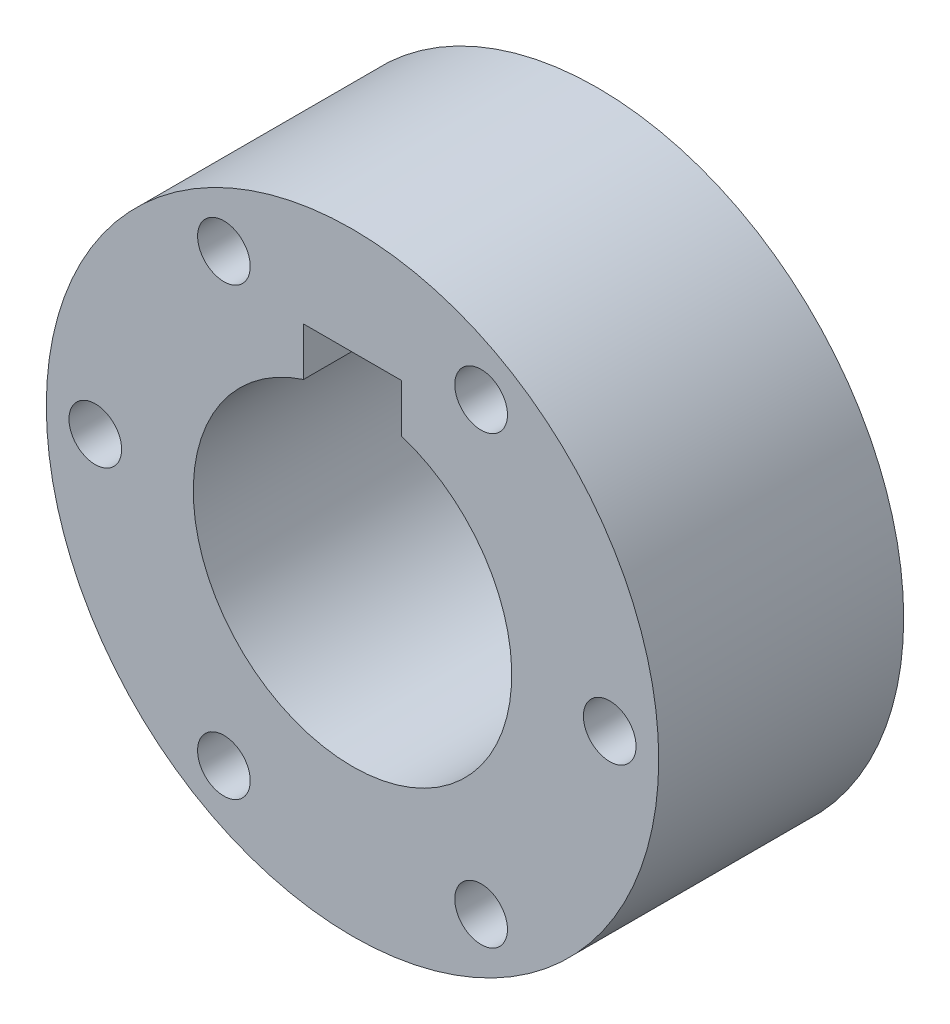
ISO-10303-21;
HEADER;
FILE_DESCRIPTION(('STEP AP214'),'2;1');
FILE_NAME('part.step','',(''),(''),'','','');
FILE_SCHEMA(('AUTOMOTIVE_DESIGN { 1 0 10303 214 1 1 1 1 }'));
ENDSEC;
DATA;
#1=APPLICATION_CONTEXT('core data for automotive mechanical design processes');
#2=APPLICATION_PROTOCOL_DEFINITION('international standard','automotive_design',2000,#1);
#3=PRODUCT_CONTEXT('',#1,'mechanical');
#4=PRODUCT('Part','Part','',(#3));
#5=PRODUCT_RELATED_PRODUCT_CATEGORY('part','',(#4));
#6=PRODUCT_DEFINITION_FORMATION('','',#4);
#7=PRODUCT_DEFINITION_CONTEXT('part definition',#1,'design');
#8=PRODUCT_DEFINITION('design','',#6,#7);
#9=PRODUCT_DEFINITION_SHAPE('','',#8);
#10=(LENGTH_UNIT() NAMED_UNIT(*) SI_UNIT(.MILLI.,.METRE.));
#11=(NAMED_UNIT(*) PLANE_ANGLE_UNIT() SI_UNIT($,.RADIAN.));
#12=(NAMED_UNIT(*) SI_UNIT($,.STERADIAN.) SOLID_ANGLE_UNIT());
#13=UNCERTAINTY_MEASURE_WITH_UNIT(LENGTH_MEASURE(1.E-05),#10,'distance_accuracy_value','');
#14=(GEOMETRIC_REPRESENTATION_CONTEXT(3) GLOBAL_UNCERTAINTY_ASSIGNED_CONTEXT((#13)) GLOBAL_UNIT_ASSIGNED_CONTEXT((#10,
#11,#12)) REPRESENTATION_CONTEXT('',''));
#15=CARTESIAN_POINT('',(0.,0.,0.));
#16=DIRECTION('',(0.,0.,1.));
#17=DIRECTION('',(1.,0.,0.));
#18=AXIS2_PLACEMENT_3D('',#15,#16,#17);
#19=CARTESIAN_POINT('',(0.,0.,20.));
#20=DIRECTION('',(0.,0.,-1.));
#21=DIRECTION('',(-1.,0.,0.));
#22=AXIS2_PLACEMENT_3D('',#19,#20,#21);
#23=CYLINDRICAL_SURFACE('',#22,25.);
#24=CARTESIAN_POINT('',(0.,0.,20.));
#25=DIRECTION('',(0.,0.,1.));
#26=DIRECTION('',(1.,0.,0.));
#27=AXIS2_PLACEMENT_3D('',#24,#25,#26);
#28=CIRCLE('',#27,25.);
#29=CARTESIAN_POINT('',(25.,0.,20.));
#30=VERTEX_POINT('',#29);
#31=EDGE_CURVE('E11',#30,#30,#28,.T.);
#32=ORIENTED_EDGE('',*,*,#31,.F.);
#33=EDGE_LOOP('',(#32));
#34=FACE_BOUND('',#33,.T.);
#35=CARTESIAN_POINT('',(0.,0.,0.));
#36=DIRECTION('',(0.,0.,1.));
#37=DIRECTION('',(1.,0.,0.));
#38=AXIS2_PLACEMENT_3D('',#35,#36,#37);
#39=CIRCLE('',#38,25.);
#40=CARTESIAN_POINT('',(25.,0.,0.));
#41=VERTEX_POINT('',#40);
#42=EDGE_CURVE('E37',#41,#41,#39,.T.);
#43=ORIENTED_EDGE('',*,*,#42,.T.);
#44=EDGE_LOOP('',(#43));
#45=FACE_BOUND('',#44,.T.);
#46=ADVANCED_FACE('F34',(#34,#45),#23,.T.);
#47=CARTESIAN_POINT('',(0.,0.,20.));
#48=DIRECTION('',(0.,0.,1.));
#49=DIRECTION('',(1.,0.,0.));
#50=AXIS2_PLACEMENT_3D('',#47,#48,#49);
#51=PLANE('',#50);
#52=CARTESIAN_POINT('',(21.,0.,20.));
#53=DIRECTION('',(0.,0.,1.));
#54=DIRECTION('',(1.,0.,0.));
#55=AXIS2_PLACEMENT_3D('',#52,#53,#54);
#56=CIRCLE('',#55,2.15);
#57=CARTESIAN_POINT('',(23.15,0.,20.));
#58=VERTEX_POINT('',#57);
#59=EDGE_CURVE('E184',#58,#58,#56,.T.);
#60=ORIENTED_EDGE('',*,*,#59,.F.);
#61=EDGE_LOOP('',(#60));
#62=FACE_BOUND('',#61,.T.);
#63=CARTESIAN_POINT('',(10.5,-18.1865334794732,20.));
#64=DIRECTION('',(0.,0.,1.));
#65=DIRECTION('',(1.,0.,0.));
#66=AXIS2_PLACEMENT_3D('',#63,#64,#65);
#67=CIRCLE('',#66,2.15);
#68=CARTESIAN_POINT('',(12.65,-18.1865334794732,20.));
#69=VERTEX_POINT('',#68);
#70=EDGE_CURVE('E186',#69,#69,#67,.T.);
#71=ORIENTED_EDGE('',*,*,#70,.F.);
#72=EDGE_LOOP('',(#71));
#73=FACE_BOUND('',#72,.T.);
#74=CARTESIAN_POINT('',(-10.5,-18.1865334794732,20.));
#75=DIRECTION('',(0.,0.,1.));
#76=DIRECTION('',(1.,0.,0.));
#77=AXIS2_PLACEMENT_3D('',#74,#75,#76);
#78=CIRCLE('',#77,2.15);
#79=CARTESIAN_POINT('',(-8.35,-18.1865334794732,20.));
#80=VERTEX_POINT('',#79);
#81=EDGE_CURVE('E194',#80,#80,#78,.T.);
#82=ORIENTED_EDGE('',*,*,#81,.F.);
#83=EDGE_LOOP('',(#82));
#84=FACE_BOUND('',#83,.T.);
#85=CARTESIAN_POINT('',(-21.,0.,20.));
#86=DIRECTION('',(0.,0.,1.));
#87=DIRECTION('',(1.,0.,0.));
#88=AXIS2_PLACEMENT_3D('',#85,#86,#87);
#89=CIRCLE('',#88,2.15);
#90=CARTESIAN_POINT('',(-18.85,0.,20.));
#91=VERTEX_POINT('',#90);
#92=EDGE_CURVE('E200',#91,#91,#89,.T.);
#93=ORIENTED_EDGE('',*,*,#92,.F.);
#94=EDGE_LOOP('',(#93));
#95=FACE_BOUND('',#94,.T.);
#96=CARTESIAN_POINT('',(-10.5,18.1865334794732,20.));
#97=DIRECTION('',(0.,0.,1.));
#98=DIRECTION('',(1.,0.,0.));
#99=AXIS2_PLACEMENT_3D('',#96,#97,#98);
#100=CIRCLE('',#99,2.15);
#101=CARTESIAN_POINT('',(-8.35000000000001,18.1865334794732,20.));
#102=VERTEX_POINT('',#101);
#103=EDGE_CURVE('E206',#102,#102,#100,.T.);
#104=ORIENTED_EDGE('',*,*,#103,.F.);
#105=EDGE_LOOP('',(#104));
#106=FACE_BOUND('',#105,.T.);
#107=CARTESIAN_POINT('',(10.5,18.1865334794732,20.));
#108=DIRECTION('',(0.,0.,1.));
#109=DIRECTION('',(1.,0.,0.));
#110=AXIS2_PLACEMENT_3D('',#107,#108,#109);
#111=CIRCLE('',#110,2.15);
#112=CARTESIAN_POINT('',(12.65,18.1865334794732,20.));
#113=VERTEX_POINT('',#112);
#114=EDGE_CURVE('E211',#113,#113,#111,.T.);
#115=ORIENTED_EDGE('',*,*,#114,.F.);
#116=EDGE_LOOP('',(#115));
#117=FACE_BOUND('',#116,.T.);
#118=DIRECTION('',(-1.,0.,0.));
#119=VECTOR('',#118,1.);
#120=CARTESIAN_POINT('',(3.99999999999999,16.3,20.));
#121=LINE('',#120,#119);
#122=CARTESIAN_POINT('',(3.99999999999999,16.3,20.));
#123=VERTEX_POINT('',#122);
#124=CARTESIAN_POINT('',(-4.00000000000001,16.3,20.));
#125=VERTEX_POINT('',#124);
#126=EDGE_CURVE('E48',#123,#125,#121,.T.);
#127=ORIENTED_EDGE('',*,*,#126,.F.);
#128=DIRECTION('',(0.,-1.,0.));
#129=VECTOR('',#128,1.);
#130=CARTESIAN_POINT('',(3.99999999999999,16.3,20.));
#131=LINE('',#130,#129);
#132=CARTESIAN_POINT('',(4.,12.369316876853,20.));
#133=VERTEX_POINT('',#132);
#134=EDGE_CURVE('E92',#123,#133,#131,.T.);
#135=ORIENTED_EDGE('',*,*,#134,.T.);
#136=CARTESIAN_POINT('',(0.,0.,20.));
#137=DIRECTION('',(0.,0.,1.));
#138=DIRECTION('',(1.,0.,0.));
#139=AXIS2_PLACEMENT_3D('',#136,#137,#138);
#140=CIRCLE('',#139,13.);
#141=CARTESIAN_POINT('',(-4.00000000000001,12.369316876853,20.));
#142=VERTEX_POINT('',#141);
#143=EDGE_CURVE('E95',#142,#133,#140,.T.);
#144=ORIENTED_EDGE('',*,*,#143,.F.);
#145=DIRECTION('',(0.,1.,0.));
#146=VECTOR('',#145,1.);
#147=CARTESIAN_POINT('',(-4.00000000000001,12.369316876853,20.));
#148=LINE('',#147,#146);
#149=EDGE_CURVE('E104',#142,#125,#148,.T.);
#150=ORIENTED_EDGE('',*,*,#149,.T.);
#151=EDGE_LOOP('',(#127,#135,#144,#150));
#152=FACE_BOUND('',#151,.T.);
#153=ORIENTED_EDGE('',*,*,#31,.T.);
#154=EDGE_LOOP('',(#153));
#155=FACE_BOUND('',#154,.T.);
#156=ADVANCED_FACE('F115',(#62,#73,#84,#95,#106,#117,#152,#155),#51,.T.);
#157=CARTESIAN_POINT('',(0.,0.,0.));
#158=DIRECTION('',(0.,0.,1.));
#159=DIRECTION('',(1.,0.,0.));
#160=AXIS2_PLACEMENT_3D('',#157,#158,#159);
#161=PLANE('',#160);
#162=CARTESIAN_POINT('',(21.,0.,0.));
#163=DIRECTION('',(0.,0.,1.));
#164=DIRECTION('',(1.,0.,0.));
#165=AXIS2_PLACEMENT_3D('',#162,#163,#164);
#166=CIRCLE('',#165,2.15);
#167=CARTESIAN_POINT('',(23.15,0.,0.));
#168=VERTEX_POINT('',#167);
#169=EDGE_CURVE('E181',#168,#168,#166,.T.);
#170=ORIENTED_EDGE('',*,*,#169,.T.);
#171=EDGE_LOOP('',(#170));
#172=FACE_BOUND('',#171,.T.);
#173=CARTESIAN_POINT('',(10.5,-18.1865334794732,0.));
#174=DIRECTION('',(0.,0.,1.));
#175=DIRECTION('',(1.,0.,0.));
#176=AXIS2_PLACEMENT_3D('',#173,#174,#175);
#177=CIRCLE('',#176,2.15);
#178=CARTESIAN_POINT('',(12.65,-18.1865334794732,0.));
#179=VERTEX_POINT('',#178);
#180=EDGE_CURVE('E191',#179,#179,#177,.T.);
#181=ORIENTED_EDGE('',*,*,#180,.T.);
#182=EDGE_LOOP('',(#181));
#183=FACE_BOUND('',#182,.T.);
#184=CARTESIAN_POINT('',(-10.5,-18.1865334794732,0.));
#185=DIRECTION('',(0.,0.,1.));
#186=DIRECTION('',(1.,0.,0.));
#187=AXIS2_PLACEMENT_3D('',#184,#185,#186);
#188=CIRCLE('',#187,2.15);
#189=CARTESIAN_POINT('',(-8.35,-18.1865334794732,0.));
#190=VERTEX_POINT('',#189);
#191=EDGE_CURVE('E197',#190,#190,#188,.T.);
#192=ORIENTED_EDGE('',*,*,#191,.T.);
#193=EDGE_LOOP('',(#192));
#194=FACE_BOUND('',#193,.T.);
#195=CARTESIAN_POINT('',(-21.,0.,0.));
#196=DIRECTION('',(0.,0.,1.));
#197=DIRECTION('',(1.,0.,0.));
#198=AXIS2_PLACEMENT_3D('',#195,#196,#197);
#199=CIRCLE('',#198,2.15);
#200=CARTESIAN_POINT('',(-18.85,0.,0.));
#201=VERTEX_POINT('',#200);
#202=EDGE_CURVE('E203',#201,#201,#199,.T.);
#203=ORIENTED_EDGE('',*,*,#202,.T.);
#204=EDGE_LOOP('',(#203));
#205=FACE_BOUND('',#204,.T.);
#206=CARTESIAN_POINT('',(-10.5,18.1865334794732,0.));
#207=DIRECTION('',(0.,0.,1.));
#208=DIRECTION('',(1.,0.,0.));
#209=AXIS2_PLACEMENT_3D('',#206,#207,#208);
#210=CIRCLE('',#209,2.15);
#211=CARTESIAN_POINT('',(-8.35000000000001,18.1865334794732,0.));
#212=VERTEX_POINT('',#211);
#213=EDGE_CURVE('E209',#212,#212,#210,.T.);
#214=ORIENTED_EDGE('',*,*,#213,.T.);
#215=EDGE_LOOP('',(#214));
#216=FACE_BOUND('',#215,.T.);
#217=CARTESIAN_POINT('',(10.5,18.1865334794732,0.));
#218=DIRECTION('',(0.,0.,1.));
#219=DIRECTION('',(1.,0.,0.));
#220=AXIS2_PLACEMENT_3D('',#217,#218,#219);
#221=CIRCLE('',#220,2.15);
#222=CARTESIAN_POINT('',(12.65,18.1865334794732,0.));
#223=VERTEX_POINT('',#222);
#224=EDGE_CURVE('E98',#223,#223,#221,.T.);
#225=ORIENTED_EDGE('',*,*,#224,.T.);
#226=EDGE_LOOP('',(#225));
#227=FACE_BOUND('',#226,.T.);
#228=DIRECTION('',(0.,-1.,0.));
#229=VECTOR('',#228,1.);
#230=CARTESIAN_POINT('',(3.99999999999999,16.3,0.));
#231=LINE('',#230,#229);
#232=CARTESIAN_POINT('',(3.99999999999999,16.3,0.));
#233=VERTEX_POINT('',#232);
#234=CARTESIAN_POINT('',(4.,12.369316876853,0.));
#235=VERTEX_POINT('',#234);
#236=EDGE_CURVE('E88',#233,#235,#231,.T.);
#237=ORIENTED_EDGE('',*,*,#236,.F.);
#238=DIRECTION('',(-1.,0.,0.));
#239=VECTOR('',#238,1.);
#240=CARTESIAN_POINT('',(3.99999999999999,16.3,0.));
#241=LINE('',#240,#239);
#242=CARTESIAN_POINT('',(-4.00000000000001,16.3,0.));
#243=VERTEX_POINT('',#242);
#244=EDGE_CURVE('E83',#233,#243,#241,.T.);
#245=ORIENTED_EDGE('',*,*,#244,.T.);
#246=DIRECTION('',(0.,1.,0.));
#247=VECTOR('',#246,1.);
#248=CARTESIAN_POINT('',(-4.00000000000001,12.369316876853,0.));
#249=LINE('',#248,#247);
#250=CARTESIAN_POINT('',(-4.00000000000001,12.369316876853,0.));
#251=VERTEX_POINT('',#250);
#252=EDGE_CURVE('E75',#251,#243,#249,.T.);
#253=ORIENTED_EDGE('',*,*,#252,.F.);
#254=CARTESIAN_POINT('',(0.,0.,0.));
#255=DIRECTION('',(0.,0.,1.));
#256=DIRECTION('',(1.,0.,0.));
#257=AXIS2_PLACEMENT_3D('',#254,#255,#256);
#258=CIRCLE('',#257,13.);
#259=EDGE_CURVE('E56',#251,#235,#258,.T.);
#260=ORIENTED_EDGE('',*,*,#259,.T.);
#261=EDGE_LOOP('',(#237,#245,#253,#260));
#262=FACE_BOUND('',#261,.T.);
#263=ORIENTED_EDGE('',*,*,#42,.F.);
#264=EDGE_LOOP('',(#263));
#265=FACE_BOUND('',#264,.T.);
#266=ADVANCED_FACE('F90',(#172,#183,#194,#205,#216,#227,#262,#265),#161,.F.);
#267=CARTESIAN_POINT('',(3.99999999999999,16.3,0.));
#268=DIRECTION('',(0.,1.,0.));
#269=DIRECTION('',(-1.,0.,0.));
#270=AXIS2_PLACEMENT_3D('',#267,#268,#269);
#271=PLANE('',#270);
#272=ORIENTED_EDGE('',*,*,#126,.T.);
#273=DIRECTION('',(0.,0.,1.));
#274=VECTOR('',#273,1.);
#275=CARTESIAN_POINT('',(-4.00000000000001,16.3,0.));
#276=LINE('',#275,#274);
#277=EDGE_CURVE('E78',#243,#125,#276,.T.);
#278=ORIENTED_EDGE('',*,*,#277,.F.);
#279=ORIENTED_EDGE('',*,*,#244,.F.);
#280=DIRECTION('',(0.,0.,1.));
#281=VECTOR('',#280,1.);
#282=CARTESIAN_POINT('',(3.99999999999999,16.3,0.));
#283=LINE('',#282,#281);
#284=EDGE_CURVE('E108',#233,#123,#283,.T.);
#285=ORIENTED_EDGE('',*,*,#284,.T.);
#286=EDGE_LOOP('',(#272,#278,#279,#285));
#287=FACE_BOUND('',#286,.T.);
#288=ADVANCED_FACE('F86',(#287),#271,.F.);
#289=CARTESIAN_POINT('',(3.99999999999999,16.3,0.));
#290=DIRECTION('',(-1.,0.,0.));
#291=DIRECTION('',(0.,-1.,0.));
#292=AXIS2_PLACEMENT_3D('',#289,#290,#291);
#293=PLANE('',#292);
#294=ORIENTED_EDGE('',*,*,#134,.F.);
#295=ORIENTED_EDGE('',*,*,#284,.F.);
#296=ORIENTED_EDGE('',*,*,#236,.T.);
#297=DIRECTION('',(0.,0.,1.));
#298=VECTOR('',#297,1.);
#299=CARTESIAN_POINT('',(4.,12.369316876853,0.));
#300=LINE('',#299,#298);
#301=EDGE_CURVE('E110',#235,#133,#300,.T.);
#302=ORIENTED_EDGE('',*,*,#301,.T.);
#303=EDGE_LOOP('',(#294,#295,#296,#302));
#304=FACE_BOUND('',#303,.T.);
#305=ADVANCED_FACE('F119',(#304),#293,.T.);
#306=CARTESIAN_POINT('',(0.,0.,0.));
#307=DIRECTION('',(0.,0.,1.));
#308=DIRECTION('',(1.,0.,0.));
#309=AXIS2_PLACEMENT_3D('',#306,#307,#308);
#310=CYLINDRICAL_SURFACE('',#309,13.);
#311=ORIENTED_EDGE('',*,*,#143,.T.);
#312=ORIENTED_EDGE('',*,*,#301,.F.);
#313=ORIENTED_EDGE('',*,*,#259,.F.);
#314=DIRECTION('',(0.,0.,1.));
#315=VECTOR('',#314,1.);
#316=CARTESIAN_POINT('',(-4.00000000000001,12.369316876853,0.));
#317=LINE('',#316,#315);
#318=EDGE_CURVE('E80',#251,#142,#317,.T.);
#319=ORIENTED_EDGE('',*,*,#318,.T.);
#320=EDGE_LOOP('',(#311,#312,#313,#319));
#321=FACE_BOUND('',#320,.T.);
#322=ADVANCED_FACE('F112',(#321),#310,.F.);
#323=CARTESIAN_POINT('',(-4.00000000000001,12.369316876853,0.));
#324=DIRECTION('',(1.,0.,0.));
#325=DIRECTION('',(0.,1.,0.));
#326=AXIS2_PLACEMENT_3D('',#323,#324,#325);
#327=PLANE('',#326);
#328=ORIENTED_EDGE('',*,*,#149,.F.);
#329=ORIENTED_EDGE('',*,*,#318,.F.);
#330=ORIENTED_EDGE('',*,*,#252,.T.);
#331=ORIENTED_EDGE('',*,*,#277,.T.);
#332=EDGE_LOOP('',(#328,#329,#330,#331));
#333=FACE_BOUND('',#332,.T.);
#334=ADVANCED_FACE('F77',(#333),#327,.T.);
#335=CARTESIAN_POINT('',(10.5,18.1865334794732,20.));
#336=DIRECTION('',(0.,0.,1.));
#337=DIRECTION('',(1.,0.,0.));
#338=AXIS2_PLACEMENT_3D('',#335,#336,#337);
#339=CYLINDRICAL_SURFACE('',#338,2.15);
#340=ORIENTED_EDGE('',*,*,#224,.F.);
#341=EDGE_LOOP('',(#340));
#342=FACE_BOUND('',#341,.T.);
#343=ORIENTED_EDGE('',*,*,#114,.T.);
#344=EDGE_LOOP('',(#343));
#345=FACE_BOUND('',#344,.T.);
#346=ADVANCED_FACE('F148',(#342,#345),#339,.F.);
#347=CARTESIAN_POINT('',(-10.5,18.1865334794732,20.));
#348=DIRECTION('',(0.,0.,1.));
#349=DIRECTION('',(1.,0.,0.));
#350=AXIS2_PLACEMENT_3D('',#347,#348,#349);
#351=CYLINDRICAL_SURFACE('',#350,2.15);
#352=ORIENTED_EDGE('',*,*,#213,.F.);
#353=EDGE_LOOP('',(#352));
#354=FACE_BOUND('',#353,.T.);
#355=ORIENTED_EDGE('',*,*,#103,.T.);
#356=EDGE_LOOP('',(#355));
#357=FACE_BOUND('',#356,.T.);
#358=ADVANCED_FACE('F152',(#354,#357),#351,.F.);
#359=CARTESIAN_POINT('',(-21.,0.,20.));
#360=DIRECTION('',(0.,0.,1.));
#361=DIRECTION('',(1.,0.,0.));
#362=AXIS2_PLACEMENT_3D('',#359,#360,#361);
#363=CYLINDRICAL_SURFACE('',#362,2.15);
#364=ORIENTED_EDGE('',*,*,#202,.F.);
#365=EDGE_LOOP('',(#364));
#366=FACE_BOUND('',#365,.T.);
#367=ORIENTED_EDGE('',*,*,#92,.T.);
#368=EDGE_LOOP('',(#367));
#369=FACE_BOUND('',#368,.T.);
#370=ADVANCED_FACE('F157',(#366,#369),#363,.F.);
#371=CARTESIAN_POINT('',(-10.5,-18.1865334794732,20.));
#372=DIRECTION('',(0.,0.,1.));
#373=DIRECTION('',(1.,0.,0.));
#374=AXIS2_PLACEMENT_3D('',#371,#372,#373);
#375=CYLINDRICAL_SURFACE('',#374,2.15);
#376=ORIENTED_EDGE('',*,*,#191,.F.);
#377=EDGE_LOOP('',(#376));
#378=FACE_BOUND('',#377,.T.);
#379=ORIENTED_EDGE('',*,*,#81,.T.);
#380=EDGE_LOOP('',(#379));
#381=FACE_BOUND('',#380,.T.);
#382=ADVANCED_FACE('F165',(#378,#381),#375,.F.);
#383=CARTESIAN_POINT('',(10.5,-18.1865334794732,20.));
#384=DIRECTION('',(0.,0.,1.));
#385=DIRECTION('',(1.,0.,0.));
#386=AXIS2_PLACEMENT_3D('',#383,#384,#385);
#387=CYLINDRICAL_SURFACE('',#386,2.15);
#388=ORIENTED_EDGE('',*,*,#180,.F.);
#389=EDGE_LOOP('',(#388));
#390=FACE_BOUND('',#389,.T.);
#391=ORIENTED_EDGE('',*,*,#70,.T.);
#392=EDGE_LOOP('',(#391));
#393=FACE_BOUND('',#392,.T.);
#394=ADVANCED_FACE('F169',(#390,#393),#387,.F.);
#395=CARTESIAN_POINT('',(21.,0.,20.));
#396=DIRECTION('',(0.,0.,1.));
#397=DIRECTION('',(1.,0.,0.));
#398=AXIS2_PLACEMENT_3D('',#395,#396,#397);
#399=CYLINDRICAL_SURFACE('',#398,2.15);
#400=ORIENTED_EDGE('',*,*,#169,.F.);
#401=EDGE_LOOP('',(#400));
#402=FACE_BOUND('',#401,.T.);
#403=ORIENTED_EDGE('',*,*,#59,.T.);
#404=EDGE_LOOP('',(#403));
#405=FACE_BOUND('',#404,.T.);
#406=ADVANCED_FACE('F173',(#402,#405),#399,.F.);
#407=CLOSED_SHELL('',(#46,#156,#266,#288,#305,#322,#334,#346,#358,#370,#382,#394,#406));
#408=MANIFOLD_SOLID_BREP('B2',#407);
#409=ADVANCED_BREP_SHAPE_REPRESENTATION('',(#18,#408),#14);
#410=SHAPE_DEFINITION_REPRESENTATION(#9,#409);
ENDSEC;
END-ISO-10303-21;
